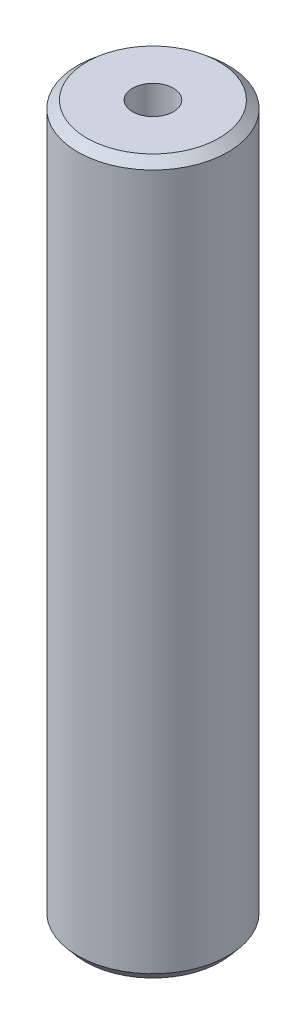
ISO-10303-21;
HEADER;
FILE_DESCRIPTION(('STEP AP214'),'2;1');
FILE_NAME('part.step','',(''),(''),'','','');
FILE_SCHEMA(('AUTOMOTIVE_DESIGN { 1 0 10303 214 1 1 1 1 }'));
ENDSEC;
DATA;
#1=APPLICATION_CONTEXT('core data for automotive mechanical design processes');
#2=APPLICATION_PROTOCOL_DEFINITION('international standard','automotive_design',2000,#1);
#3=PRODUCT_CONTEXT('',#1,'mechanical');
#4=PRODUCT('Part','Part','',(#3));
#5=PRODUCT_RELATED_PRODUCT_CATEGORY('part','',(#4));
#6=PRODUCT_DEFINITION_FORMATION('','',#4);
#7=PRODUCT_DEFINITION_CONTEXT('part definition',#1,'design');
#8=PRODUCT_DEFINITION('design','',#6,#7);
#9=PRODUCT_DEFINITION_SHAPE('','',#8);
#10=(LENGTH_UNIT() NAMED_UNIT(*) SI_UNIT(.MILLI.,.METRE.));
#11=(NAMED_UNIT(*) PLANE_ANGLE_UNIT() SI_UNIT($,.RADIAN.));
#12=(NAMED_UNIT(*) SI_UNIT($,.STERADIAN.) SOLID_ANGLE_UNIT());
#13=UNCERTAINTY_MEASURE_WITH_UNIT(LENGTH_MEASURE(1.E-05),#10,'distance_accuracy_value','');
#14=(GEOMETRIC_REPRESENTATION_CONTEXT(3) GLOBAL_UNCERTAINTY_ASSIGNED_CONTEXT((#13)) GLOBAL_UNIT_ASSIGNED_CONTEXT((#10,
#11,#12)) REPRESENTATION_CONTEXT('',''));
#15=CARTESIAN_POINT('',(0.,0.,0.));
#16=DIRECTION('',(0.,0.,1.));
#17=DIRECTION('',(1.,0.,0.));
#18=AXIS2_PLACEMENT_3D('',#15,#16,#17);
#19=CARTESIAN_POINT('',(0.,71.1372542325314,0.));
#20=DIRECTION('',(0.,-1.,0.));
#21=DIRECTION('',(0.,0.,-1.));
#22=AXIS2_PLACEMENT_3D('',#19,#20,#21);
#23=CYLINDRICAL_SURFACE('',#22,7.5);
#24=CARTESIAN_POINT('',(0.,70.3824002748317,0.));
#25=DIRECTION('',(0.,1.,0.));
#26=DIRECTION('',(0.,0.,1.));
#27=AXIS2_PLACEMENT_3D('',#24,#25,#26);
#28=CIRCLE('',#27,7.5);
#29=CARTESIAN_POINT('',(0.,70.3824002748317,7.5));
#30=VERTEX_POINT('',#29);
#31=EDGE_CURVE('E50',#30,#30,#28,.F.);
#32=ORIENTED_EDGE('',*,*,#31,.T.);
#33=EDGE_LOOP('',(#32));
#34=FACE_BOUND('',#33,.T.);
#35=CARTESIAN_POINT('',(0.,0.899588545220709,0.));
#36=DIRECTION('',(0.,1.,0.));
#37=DIRECTION('',(0.,0.,1.));
#38=AXIS2_PLACEMENT_3D('',#35,#36,#37);
#39=CIRCLE('',#38,7.5);
#40=CARTESIAN_POINT('',(0.,0.899588545220709,7.5));
#41=VERTEX_POINT('',#40);
#42=EDGE_CURVE('E51',#41,#41,#39,.T.);
#43=ORIENTED_EDGE('',*,*,#42,.T.);
#44=EDGE_LOOP('',(#43));
#45=FACE_BOUND('',#44,.T.);
#46=ADVANCED_FACE('F39',(#34,#45),#23,.T.);
#47=CARTESIAN_POINT('',(0.,71.1372542325314,0.));
#48=DIRECTION('',(0.,1.,0.));
#49=DIRECTION('',(0.,0.,1.));
#50=AXIS2_PLACEMENT_3D('',#47,#48,#49);
#51=PLANE('',#50);
#52=CARTESIAN_POINT('',(0.,71.1372542325314,0.));
#53=DIRECTION('',(0.,1.,0.));
#54=DIRECTION('',(0.,0.,1.));
#55=AXIS2_PLACEMENT_3D('',#52,#53,#54);
#56=CIRCLE('',#55,6.60041145477931);
#57=CARTESIAN_POINT('',(0.,71.1372542325314,6.60041145477931));
#58=VERTEX_POINT('',#57);
#59=EDGE_CURVE('E54',#58,#58,#56,.T.);
#60=ORIENTED_EDGE('',*,*,#59,.T.);
#61=EDGE_LOOP('',(#60));
#62=FACE_BOUND('',#61,.T.);
#63=CARTESIAN_POINT('',(0.,71.1372542325314,0.));
#64=DIRECTION('',(0.,1.,0.));
#65=DIRECTION('',(0.,0.,1.));
#66=AXIS2_PLACEMENT_3D('',#63,#64,#65);
#67=CIRCLE('',#66,2.03678356051834);
#68=CARTESIAN_POINT('',(0.,71.1372542325314,2.03678356051834));
#69=VERTEX_POINT('',#68);
#70=EDGE_CURVE('E58',#69,#69,#67,.T.);
#71=ORIENTED_EDGE('',*,*,#70,.F.);
#72=EDGE_LOOP('',(#71));
#73=FACE_BOUND('',#72,.T.);
#74=ADVANCED_FACE('F69',(#62,#73),#51,.T.);
#75=CARTESIAN_POINT('',(0.,0.,0.));
#76=DIRECTION('',(0.,1.,0.));
#77=DIRECTION('',(0.,0.,1.));
#78=AXIS2_PLACEMENT_3D('',#75,#76,#77);
#79=PLANE('',#78);
#80=CARTESIAN_POINT('',(0.,0.,0.));
#81=DIRECTION('',(0.,1.,0.));
#82=DIRECTION('',(0.,0.,1.));
#83=AXIS2_PLACEMENT_3D('',#80,#81,#82);
#84=CIRCLE('',#83,6.74514604230032);
#85=CARTESIAN_POINT('',(0.,0.,6.74514604230032));
#86=VERTEX_POINT('',#85);
#87=EDGE_CURVE('E10',#86,#86,#84,.F.);
#88=ORIENTED_EDGE('',*,*,#87,.T.);
#89=EDGE_LOOP('',(#88));
#90=FACE_BOUND('',#89,.T.);
#91=CARTESIAN_POINT('',(0.,0.,0.));
#92=DIRECTION('',(0.,1.,0.));
#93=DIRECTION('',(0.,0.,1.));
#94=AXIS2_PLACEMENT_3D('',#91,#92,#93);
#95=CIRCLE('',#94,2.03678356051834);
#96=CARTESIAN_POINT('',(0.,0.,2.03678356051834));
#97=VERTEX_POINT('',#96);
#98=EDGE_CURVE('E63',#97,#97,#95,.T.);
#99=ORIENTED_EDGE('',*,*,#98,.T.);
#100=EDGE_LOOP('',(#99));
#101=FACE_BOUND('',#100,.T.);
#102=ADVANCED_FACE('F75',(#90,#101),#79,.F.);
#103=CARTESIAN_POINT('',(0.,71.1372542325314,0.));
#104=DIRECTION('',(0.,-1.,0.));
#105=DIRECTION('',(0.,0.,-1.));
#106=AXIS2_PLACEMENT_3D('',#103,#104,#105);
#107=CYLINDRICAL_SURFACE('',#106,2.03678356051834);
#108=ORIENTED_EDGE('',*,*,#70,.T.);
#109=EDGE_LOOP('',(#108));
#110=FACE_BOUND('',#109,.T.);
#111=ORIENTED_EDGE('',*,*,#98,.F.);
#112=EDGE_LOOP('',(#111));
#113=FACE_BOUND('',#112,.T.);
#114=ADVANCED_FACE('F70',(#110,#113),#107,.F.);
#115=CARTESIAN_POINT('',(0.,71.1372542325314,0.));
#116=DIRECTION('',(0.,-1.,0.));
#117=DIRECTION('',(0.,0.,-1.));
#118=AXIS2_PLACEMENT_3D('',#115,#116,#117);
#119=CONICAL_SURFACE('',#118,6.60041145477931,0.872658402070594);
#120=ORIENTED_EDGE('',*,*,#31,.F.);
#121=EDGE_LOOP('',(#120));
#122=FACE_BOUND('',#121,.T.);
#123=ORIENTED_EDGE('',*,*,#59,.F.);
#124=EDGE_LOOP('',(#123));
#125=FACE_BOUND('',#124,.T.);
#126=ADVANCED_FACE('F81',(#122,#125),#119,.T.);
#127=CARTESIAN_POINT('',(0.,0.899588545220709,0.));
#128=DIRECTION('',(0.,1.,0.));
#129=DIRECTION('',(0.,0.,1.));
#130=AXIS2_PLACEMENT_3D('',#127,#128,#129);
#131=CONICAL_SURFACE('',#130,7.5,0.6981379247243);
#132=ORIENTED_EDGE('',*,*,#87,.F.);
#133=EDGE_LOOP('',(#132));
#134=FACE_BOUND('',#133,.T.);
#135=ORIENTED_EDGE('',*,*,#42,.F.);
#136=EDGE_LOOP('',(#135));
#137=FACE_BOUND('',#136,.T.);
#138=ADVANCED_FACE('F45',(#134,#137),#131,.T.);
#139=CLOSED_SHELL('',(#46,#74,#102,#114,#126,#138));
#140=MANIFOLD_SOLID_BREP('B2',#139);
#141=ADVANCED_BREP_SHAPE_REPRESENTATION('',(#18,#140),#14);
#142=SHAPE_DEFINITION_REPRESENTATION(#9,#141);
ENDSEC;
END-ISO-10303-21;
